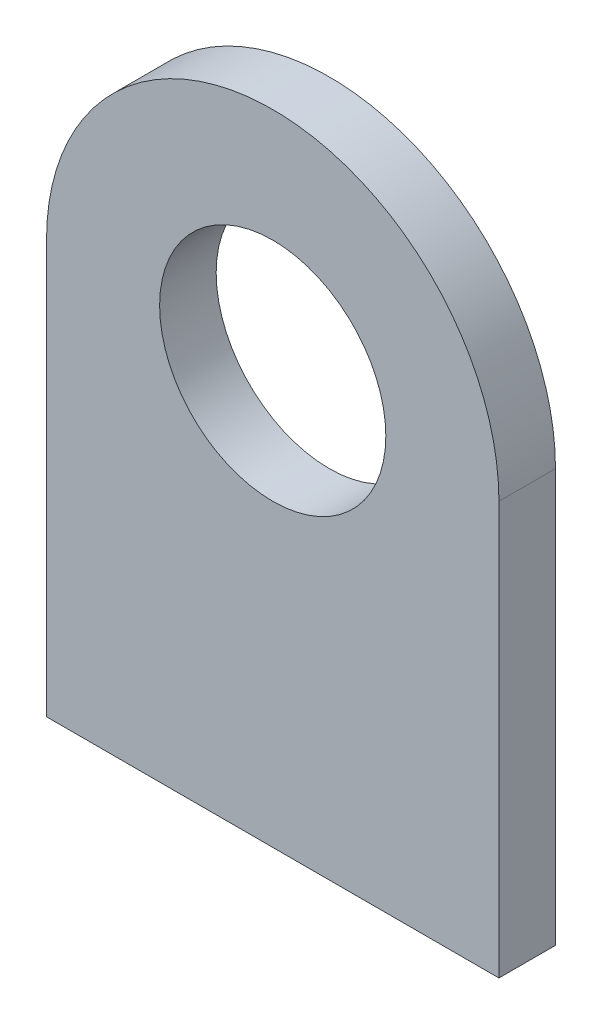
ISO-10303-21;
HEADER;
FILE_DESCRIPTION(('STEP AP214'),'2;1');
FILE_NAME('part.step','',(''),(''),'','','');
FILE_SCHEMA(('AUTOMOTIVE_DESIGN { 1 0 10303 214 1 1 1 1 }'));
ENDSEC;
DATA;
#1=APPLICATION_CONTEXT('core data for automotive mechanical design processes');
#2=APPLICATION_PROTOCOL_DEFINITION('international standard','automotive_design',2000,#1);
#3=PRODUCT_CONTEXT('',#1,'mechanical');
#4=PRODUCT('Part','Part','',(#3));
#5=PRODUCT_RELATED_PRODUCT_CATEGORY('part','',(#4));
#6=PRODUCT_DEFINITION_FORMATION('','',#4);
#7=PRODUCT_DEFINITION_CONTEXT('part definition',#1,'design');
#8=PRODUCT_DEFINITION('design','',#6,#7);
#9=PRODUCT_DEFINITION_SHAPE('','',#8);
#10=(LENGTH_UNIT() NAMED_UNIT(*) SI_UNIT(.MILLI.,.METRE.));
#11=(NAMED_UNIT(*) PLANE_ANGLE_UNIT() SI_UNIT($,.RADIAN.));
#12=(NAMED_UNIT(*) SI_UNIT($,.STERADIAN.) SOLID_ANGLE_UNIT());
#13=UNCERTAINTY_MEASURE_WITH_UNIT(LENGTH_MEASURE(1.E-05),#10,'distance_accuracy_value','');
#14=(GEOMETRIC_REPRESENTATION_CONTEXT(3) GLOBAL_UNCERTAINTY_ASSIGNED_CONTEXT((#13)) GLOBAL_UNIT_ASSIGNED_CONTEXT((#10,
#11,#12)) REPRESENTATION_CONTEXT('',''));
#15=CARTESIAN_POINT('',(0.,0.,0.));
#16=DIRECTION('',(0.,0.,1.));
#17=DIRECTION('',(1.,0.,0.));
#18=AXIS2_PLACEMENT_3D('',#15,#16,#17);
#19=CARTESIAN_POINT('',(20.6876756424581,20.35683,3.175));
#20=DIRECTION('',(0.,0.,1.));
#21=DIRECTION('',(1.,0.,0.));
#22=AXIS2_PLACEMENT_3D('',#19,#20,#21);
#23=PLANE('',#22);
#24=CARTESIAN_POINT('',(20.6876756424581,20.35683,3.175));
#25=DIRECTION('',(0.,0.,1.));
#26=DIRECTION('',(1.,0.,0.));
#27=AXIS2_PLACEMENT_3D('',#24,#25,#26);
#28=CIRCLE('',#27,12.7);
#29=CARTESIAN_POINT('',(33.3876756424581,20.35683,3.175));
#30=VERTEX_POINT('',#29);
#31=CARTESIAN_POINT('',(7.98767564245811,20.35683,3.175));
#32=VERTEX_POINT('',#31);
#33=EDGE_CURVE('E96',#30,#32,#28,.T.);
#34=ORIENTED_EDGE('',*,*,#33,.T.);
#35=DIRECTION('',(0.,-1.,0.));
#36=VECTOR('',#35,1.);
#37=CARTESIAN_POINT('',(7.98767564245811,20.35683,3.175));
#38=LINE('',#37,#36);
#39=CARTESIAN_POINT('',(7.98767564245811,-2.82067,3.175));
#40=VERTEX_POINT('',#39);
#41=EDGE_CURVE('E91',#32,#40,#38,.T.);
#42=ORIENTED_EDGE('',*,*,#41,.T.);
#43=DIRECTION('',(1.,0.,0.));
#44=VECTOR('',#43,1.);
#45=CARTESIAN_POINT('',(7.98767564245811,-2.82067,3.175));
#46=LINE('',#45,#44);
#47=CARTESIAN_POINT('',(33.3876756424581,-2.82067,3.175));
#48=VERTEX_POINT('',#47);
#49=EDGE_CURVE('E94',#40,#48,#46,.T.);
#50=ORIENTED_EDGE('',*,*,#49,.T.);
#51=DIRECTION('',(0.,1.,0.));
#52=VECTOR('',#51,1.);
#53=CARTESIAN_POINT('',(33.3876756424581,20.35683,3.175));
#54=LINE('',#53,#52);
#55=EDGE_CURVE('E61',#48,#30,#54,.T.);
#56=ORIENTED_EDGE('',*,*,#55,.T.);
#57=EDGE_LOOP('',(#34,#42,#50,#56));
#58=FACE_BOUND('',#57,.T.);
#59=CARTESIAN_POINT('',(20.6876756424581,20.35683,3.175));
#60=DIRECTION('',(0.,0.,1.));
#61=DIRECTION('',(1.,0.,0.));
#62=AXIS2_PLACEMENT_3D('',#59,#60,#61);
#63=CIRCLE('',#62,6.35);
#64=CARTESIAN_POINT('',(27.0376756424581,20.35683,3.175));
#65=VERTEX_POINT('',#64);
#66=EDGE_CURVE('E116',#65,#65,#63,.T.);
#67=ORIENTED_EDGE('',*,*,#66,.F.);
#68=EDGE_LOOP('',(#67));
#69=FACE_BOUND('',#68,.T.);
#70=ADVANCED_FACE('F43',(#58,#69),#23,.T.);
#71=CARTESIAN_POINT('',(20.6876756424581,20.35683,0.));
#72=DIRECTION('',(0.,0.,1.));
#73=DIRECTION('',(1.,0.,0.));
#74=AXIS2_PLACEMENT_3D('',#71,#72,#73);
#75=PLANE('',#74);
#76=CARTESIAN_POINT('',(20.6876756424581,20.35683,0.));
#77=DIRECTION('',(0.,0.,1.));
#78=DIRECTION('',(1.,0.,0.));
#79=AXIS2_PLACEMENT_3D('',#76,#77,#78);
#80=CIRCLE('',#79,12.7);
#81=CARTESIAN_POINT('',(33.3876756424581,20.35683,0.));
#82=VERTEX_POINT('',#81);
#83=CARTESIAN_POINT('',(7.98767564245811,20.35683,0.));
#84=VERTEX_POINT('',#83);
#85=EDGE_CURVE('E112',#82,#84,#80,.T.);
#86=ORIENTED_EDGE('',*,*,#85,.F.);
#87=DIRECTION('',(0.,1.,0.));
#88=VECTOR('',#87,1.);
#89=CARTESIAN_POINT('',(33.3876756424581,20.35683,0.));
#90=LINE('',#89,#88);
#91=CARTESIAN_POINT('',(33.3876756424581,-2.82067,0.));
#92=VERTEX_POINT('',#91);
#93=EDGE_CURVE('E84',#92,#82,#90,.T.);
#94=ORIENTED_EDGE('',*,*,#93,.F.);
#95=DIRECTION('',(1.,0.,0.));
#96=VECTOR('',#95,1.);
#97=CARTESIAN_POINT('',(7.98767564245811,-2.82067,0.));
#98=LINE('',#97,#96);
#99=CARTESIAN_POINT('',(7.98767564245811,-2.82067,0.));
#100=VERTEX_POINT('',#99);
#101=EDGE_CURVE('E78',#100,#92,#98,.T.);
#102=ORIENTED_EDGE('',*,*,#101,.F.);
#103=DIRECTION('',(0.,-1.,0.));
#104=VECTOR('',#103,1.);
#105=CARTESIAN_POINT('',(7.98767564245811,20.35683,0.));
#106=LINE('',#105,#104);
#107=EDGE_CURVE('E101',#84,#100,#106,.T.);
#108=ORIENTED_EDGE('',*,*,#107,.F.);
#109=EDGE_LOOP('',(#86,#94,#102,#108));
#110=FACE_BOUND('',#109,.T.);
#111=CARTESIAN_POINT('',(20.6876756424581,20.35683,0.));
#112=DIRECTION('',(0.,0.,1.));
#113=DIRECTION('',(1.,0.,0.));
#114=AXIS2_PLACEMENT_3D('',#111,#112,#113);
#115=CIRCLE('',#114,6.35);
#116=CARTESIAN_POINT('',(27.0376756424581,20.35683,0.));
#117=VERTEX_POINT('',#116);
#118=EDGE_CURVE('E134',#117,#117,#115,.T.);
#119=ORIENTED_EDGE('',*,*,#118,.T.);
#120=EDGE_LOOP('',(#119));
#121=FACE_BOUND('',#120,.T.);
#122=ADVANCED_FACE('F129',(#110,#121),#75,.F.);
#123=CARTESIAN_POINT('',(20.6876756424581,20.35683,3.175));
#124=DIRECTION('',(0.,0.,-1.));
#125=DIRECTION('',(-1.,0.,0.));
#126=AXIS2_PLACEMENT_3D('',#123,#124,#125);
#127=CYLINDRICAL_SURFACE('',#126,12.7);
#128=ORIENTED_EDGE('',*,*,#85,.T.);
#129=DIRECTION('',(0.,0.,-1.));
#130=VECTOR('',#129,1.);
#131=CARTESIAN_POINT('',(7.98767564245811,20.35683,3.175));
#132=LINE('',#131,#130);
#133=EDGE_CURVE('E11',#32,#84,#132,.T.);
#134=ORIENTED_EDGE('',*,*,#133,.F.);
#135=ORIENTED_EDGE('',*,*,#33,.F.);
#136=DIRECTION('',(0.,0.,-1.));
#137=VECTOR('',#136,1.);
#138=CARTESIAN_POINT('',(33.3876756424581,20.35683,3.175));
#139=LINE('',#138,#137);
#140=EDGE_CURVE('E108',#30,#82,#139,.T.);
#141=ORIENTED_EDGE('',*,*,#140,.T.);
#142=EDGE_LOOP('',(#128,#134,#135,#141));
#143=FACE_BOUND('',#142,.T.);
#144=ADVANCED_FACE('F45',(#143),#127,.T.);
#145=CARTESIAN_POINT('',(7.98767564245811,20.35683,3.175));
#146=DIRECTION('',(1.,0.,0.));
#147=DIRECTION('',(0.,0.,-1.));
#148=AXIS2_PLACEMENT_3D('',#145,#146,#147);
#149=PLANE('',#148);
#150=ORIENTED_EDGE('',*,*,#107,.T.);
#151=DIRECTION('',(0.,0.,-1.));
#152=VECTOR('',#151,1.);
#153=CARTESIAN_POINT('',(7.98767564245811,-2.82067,3.175));
#154=LINE('',#153,#152);
#155=EDGE_CURVE('E53',#40,#100,#154,.T.);
#156=ORIENTED_EDGE('',*,*,#155,.F.);
#157=ORIENTED_EDGE('',*,*,#41,.F.);
#158=ORIENTED_EDGE('',*,*,#133,.T.);
#159=EDGE_LOOP('',(#150,#156,#157,#158));
#160=FACE_BOUND('',#159,.T.);
#161=ADVANCED_FACE('F100',(#160),#149,.F.);
#162=CARTESIAN_POINT('',(7.98767564245811,-2.82067,3.175));
#163=DIRECTION('',(0.,1.,0.));
#164=DIRECTION('',(0.,0.,1.));
#165=AXIS2_PLACEMENT_3D('',#162,#163,#164);
#166=PLANE('',#165);
#167=ORIENTED_EDGE('',*,*,#101,.T.);
#168=DIRECTION('',(0.,0.,-1.));
#169=VECTOR('',#168,1.);
#170=CARTESIAN_POINT('',(33.3876756424581,-2.82067,3.175));
#171=LINE('',#170,#169);
#172=EDGE_CURVE('E103',#48,#92,#171,.T.);
#173=ORIENTED_EDGE('',*,*,#172,.F.);
#174=ORIENTED_EDGE('',*,*,#49,.F.);
#175=ORIENTED_EDGE('',*,*,#155,.T.);
#176=EDGE_LOOP('',(#167,#173,#174,#175));
#177=FACE_BOUND('',#176,.T.);
#178=ADVANCED_FACE('F104',(#177),#166,.F.);
#179=CARTESIAN_POINT('',(33.3876756424581,20.35683,3.175));
#180=DIRECTION('',(-1.,0.,0.));
#181=DIRECTION('',(0.,0.,1.));
#182=AXIS2_PLACEMENT_3D('',#179,#180,#181);
#183=PLANE('',#182);
#184=ORIENTED_EDGE('',*,*,#93,.T.);
#185=ORIENTED_EDGE('',*,*,#140,.F.);
#186=ORIENTED_EDGE('',*,*,#55,.F.);
#187=ORIENTED_EDGE('',*,*,#172,.T.);
#188=EDGE_LOOP('',(#184,#185,#186,#187));
#189=FACE_BOUND('',#188,.T.);
#190=ADVANCED_FACE('F126',(#189),#183,.F.);
#191=CARTESIAN_POINT('',(20.6876756424581,20.35683,3.175));
#192=DIRECTION('',(0.,0.,-1.));
#193=DIRECTION('',(-1.,0.,0.));
#194=AXIS2_PLACEMENT_3D('',#191,#192,#193);
#195=CYLINDRICAL_SURFACE('',#194,6.35);
#196=ORIENTED_EDGE('',*,*,#66,.T.);
#197=EDGE_LOOP('',(#196));
#198=FACE_BOUND('',#197,.T.);
#199=ORIENTED_EDGE('',*,*,#118,.F.);
#200=EDGE_LOOP('',(#199));
#201=FACE_BOUND('',#200,.T.);
#202=ADVANCED_FACE('F142',(#198,#201),#195,.F.);
#203=CLOSED_SHELL('',(#70,#122,#144,#161,#178,#190,#202));
#204=MANIFOLD_SOLID_BREP('B2',#203);
#205=ADVANCED_BREP_SHAPE_REPRESENTATION('',(#18,#204),#14);
#206=SHAPE_DEFINITION_REPRESENTATION(#9,#205);
ENDSEC;
END-ISO-10303-21;
